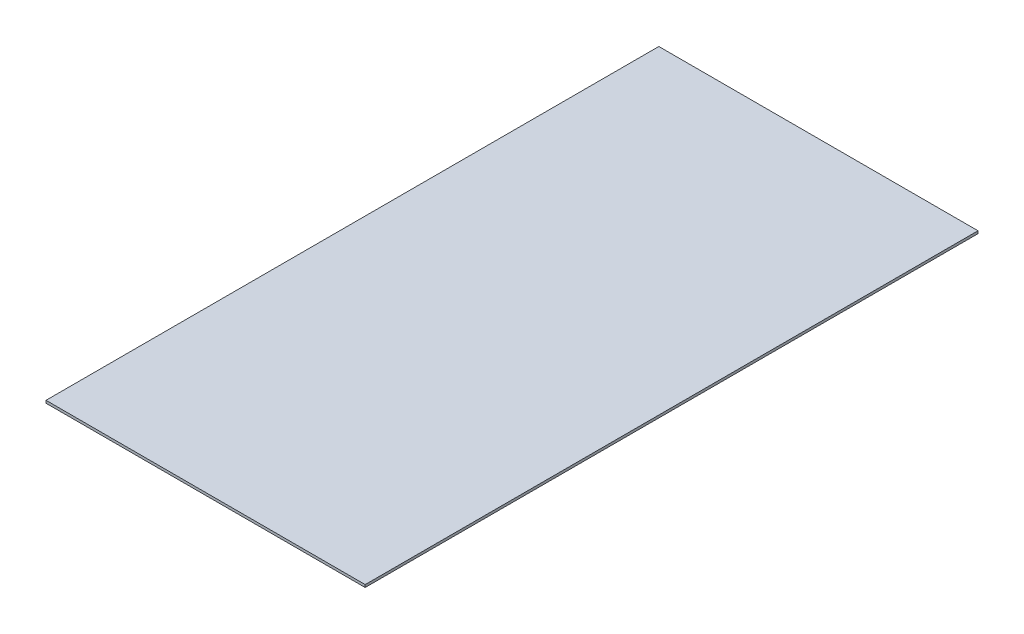
ISO-10303-21;
HEADER;
FILE_DESCRIPTION(('STEP AP214'),'2;1');
FILE_NAME('part.step','',(''),(''),'','','');
FILE_SCHEMA(('AUTOMOTIVE_DESIGN { 1 0 10303 214 1 1 1 1 }'));
ENDSEC;
DATA;
#1=APPLICATION_CONTEXT('core data for automotive mechanical design processes');
#2=APPLICATION_PROTOCOL_DEFINITION('international standard','automotive_design',2000,#1);
#3=PRODUCT_CONTEXT('',#1,'mechanical');
#4=PRODUCT('Part','Part','',(#3));
#5=PRODUCT_RELATED_PRODUCT_CATEGORY('part','',(#4));
#6=PRODUCT_DEFINITION_FORMATION('','',#4);
#7=PRODUCT_DEFINITION_CONTEXT('part definition',#1,'design');
#8=PRODUCT_DEFINITION('design','',#6,#7);
#9=PRODUCT_DEFINITION_SHAPE('','',#8);
#10=(LENGTH_UNIT() NAMED_UNIT(*) SI_UNIT(.MILLI.,.METRE.));
#11=(NAMED_UNIT(*) PLANE_ANGLE_UNIT() SI_UNIT($,.RADIAN.));
#12=(NAMED_UNIT(*) SI_UNIT($,.STERADIAN.) SOLID_ANGLE_UNIT());
#13=UNCERTAINTY_MEASURE_WITH_UNIT(LENGTH_MEASURE(1.E-05),#10,'distance_accuracy_value','');
#14=(GEOMETRIC_REPRESENTATION_CONTEXT(3) GLOBAL_UNCERTAINTY_ASSIGNED_CONTEXT((#13)) GLOBAL_UNIT_ASSIGNED_CONTEXT((#10,
#11,#12)) REPRESENTATION_CONTEXT('',''));
#15=CARTESIAN_POINT('',(0.,0.,0.));
#16=DIRECTION('',(0.,0.,1.));
#17=DIRECTION('',(1.,0.,0.));
#18=AXIS2_PLACEMENT_3D('',#15,#16,#17);
#19=CARTESIAN_POINT('',(0.,2.53999999999999,0.));
#20=DIRECTION('',(0.999999999999999,0.,0.));
#21=DIRECTION('',(0.,0.,-1.));
#22=AXIS2_PLACEMENT_3D('',#19,#20,#21);
#23=PLANE('',#22);
#24=DIRECTION('',(0.,0.,1.));
#25=VECTOR('',#24,1.);
#26=CARTESIAN_POINT('',(0.,0.,0.));
#27=LINE('',#26,#25);
#28=CARTESIAN_POINT('',(-2.22044604925031E-13,0.,-609.6));
#29=VERTEX_POINT('',#28);
#30=CARTESIAN_POINT('',(0.,0.,0.));
#31=VERTEX_POINT('',#30);
#32=EDGE_CURVE('E97',#29,#31,#27,.T.);
#33=ORIENTED_EDGE('',*,*,#32,.T.);
#34=DIRECTION('',(0.,-1.,0.));
#35=VECTOR('',#34,1.);
#36=CARTESIAN_POINT('',(0.,2.53999999999999,0.));
#37=LINE('',#36,#35);
#38=CARTESIAN_POINT('',(0.,2.53999999999999,0.));
#39=VERTEX_POINT('',#38);
#40=EDGE_CURVE('E11',#39,#31,#37,.T.);
#41=ORIENTED_EDGE('',*,*,#40,.F.);
#42=DIRECTION('',(0.,0.,1.));
#43=VECTOR('',#42,1.);
#44=CARTESIAN_POINT('',(0.,2.53999999999999,0.));
#45=LINE('',#44,#43);
#46=CARTESIAN_POINT('',(-2.22044604925031E-13,2.53999999999999,-609.6));
#47=VERTEX_POINT('',#46);
#48=EDGE_CURVE('E85',#47,#39,#45,.T.);
#49=ORIENTED_EDGE('',*,*,#48,.F.);
#50=DIRECTION('',(0.,-1.,0.));
#51=VECTOR('',#50,1.);
#52=CARTESIAN_POINT('',(-2.22044604925031E-13,2.53999999999999,-609.6));
#53=LINE('',#52,#51);
#54=EDGE_CURVE('E93',#47,#29,#53,.T.);
#55=ORIENTED_EDGE('',*,*,#54,.T.);
#56=EDGE_LOOP('',(#33,#41,#49,#55));
#57=FACE_BOUND('',#56,.T.);
#58=ADVANCED_FACE('F34',(#57),#23,.F.);
#59=CARTESIAN_POINT('',(0.,2.53999999999999,0.));
#60=DIRECTION('',(0.,0.,-1.));
#61=DIRECTION('',(-0.999999999999999,0.,0.));
#62=AXIS2_PLACEMENT_3D('',#59,#60,#61);
#63=PLANE('',#62);
#64=DIRECTION('',(0.999999999999999,0.,0.));
#65=VECTOR('',#64,1.);
#66=CARTESIAN_POINT('',(0.,0.,0.));
#67=LINE('',#66,#65);
#68=CARTESIAN_POINT('',(317.5,0.,0.));
#69=VERTEX_POINT('',#68);
#70=EDGE_CURVE('E89',#31,#69,#67,.T.);
#71=ORIENTED_EDGE('',*,*,#70,.T.);
#72=DIRECTION('',(0.,-1.,0.));
#73=VECTOR('',#72,1.);
#74=CARTESIAN_POINT('',(317.5,2.53999999999999,0.));
#75=LINE('',#74,#73);
#76=CARTESIAN_POINT('',(317.5,2.53999999999999,0.));
#77=VERTEX_POINT('',#76);
#78=EDGE_CURVE('E42',#77,#69,#75,.T.);
#79=ORIENTED_EDGE('',*,*,#78,.F.);
#80=DIRECTION('',(0.999999999999999,0.,0.));
#81=VECTOR('',#80,1.);
#82=CARTESIAN_POINT('',(0.,2.53999999999999,0.));
#83=LINE('',#82,#81);
#84=EDGE_CURVE('E80',#39,#77,#83,.T.);
#85=ORIENTED_EDGE('',*,*,#84,.F.);
#86=ORIENTED_EDGE('',*,*,#40,.T.);
#87=EDGE_LOOP('',(#71,#79,#85,#86));
#88=FACE_BOUND('',#87,.T.);
#89=ADVANCED_FACE('F88',(#88),#63,.F.);
#90=CARTESIAN_POINT('',(317.5,2.53999999999999,0.));
#91=DIRECTION('',(-0.999999999999999,0.,0.));
#92=DIRECTION('',(0.,0.,1.));
#93=AXIS2_PLACEMENT_3D('',#90,#91,#92);
#94=PLANE('',#93);
#95=DIRECTION('',(0.,0.,-1.));
#96=VECTOR('',#95,1.);
#97=CARTESIAN_POINT('',(317.5,0.,0.));
#98=LINE('',#97,#96);
#99=CARTESIAN_POINT('',(317.5,0.,-609.6));
#100=VERTEX_POINT('',#99);
#101=EDGE_CURVE('E67',#69,#100,#98,.T.);
#102=ORIENTED_EDGE('',*,*,#101,.T.);
#103=DIRECTION('',(0.,-1.,0.));
#104=VECTOR('',#103,1.);
#105=CARTESIAN_POINT('',(317.5,2.53999999999999,-609.6));
#106=LINE('',#105,#104);
#107=CARTESIAN_POINT('',(317.5,2.53999999999999,-609.6));
#108=VERTEX_POINT('',#107);
#109=EDGE_CURVE('E90',#108,#100,#106,.T.);
#110=ORIENTED_EDGE('',*,*,#109,.F.);
#111=DIRECTION('',(0.,0.,-1.));
#112=VECTOR('',#111,1.);
#113=CARTESIAN_POINT('',(317.5,2.53999999999999,0.));
#114=LINE('',#113,#112);
#115=EDGE_CURVE('E83',#77,#108,#114,.T.);
#116=ORIENTED_EDGE('',*,*,#115,.F.);
#117=ORIENTED_EDGE('',*,*,#78,.T.);
#118=EDGE_LOOP('',(#102,#110,#116,#117));
#119=FACE_BOUND('',#118,.T.);
#120=ADVANCED_FACE('F91',(#119),#94,.F.);
#121=CARTESIAN_POINT('',(-2.22044604925031E-13,2.53999999999999,-609.6));
#122=DIRECTION('',(0.,0.,1.));
#123=DIRECTION('',(0.999999999999999,0.,0.));
#124=AXIS2_PLACEMENT_3D('',#121,#122,#123);
#125=PLANE('',#124);
#126=DIRECTION('',(-0.999999999999999,0.,0.));
#127=VECTOR('',#126,1.);
#128=CARTESIAN_POINT('',(-2.22044604925031E-13,0.,-609.6));
#129=LINE('',#128,#127);
#130=EDGE_CURVE('E73',#100,#29,#129,.T.);
#131=ORIENTED_EDGE('',*,*,#130,.T.);
#132=ORIENTED_EDGE('',*,*,#54,.F.);
#133=DIRECTION('',(-0.999999999999999,0.,0.));
#134=VECTOR('',#133,1.);
#135=CARTESIAN_POINT('',(-2.22044604925031E-13,2.53999999999999,-609.6));
#136=LINE('',#135,#134);
#137=EDGE_CURVE('E50',#108,#47,#136,.T.);
#138=ORIENTED_EDGE('',*,*,#137,.F.);
#139=ORIENTED_EDGE('',*,*,#109,.T.);
#140=EDGE_LOOP('',(#131,#132,#138,#139));
#141=FACE_BOUND('',#140,.T.);
#142=ADVANCED_FACE('F104',(#141),#125,.F.);
#143=CARTESIAN_POINT('',(0.,2.53999999999999,0.));
#144=DIRECTION('',(0.,-1.,0.));
#145=DIRECTION('',(0.,0.,-1.));
#146=AXIS2_PLACEMENT_3D('',#143,#144,#145);
#147=PLANE('',#146);
#148=ORIENTED_EDGE('',*,*,#48,.T.);
#149=ORIENTED_EDGE('',*,*,#84,.T.);
#150=ORIENTED_EDGE('',*,*,#115,.T.);
#151=ORIENTED_EDGE('',*,*,#137,.T.);
#152=EDGE_LOOP('',(#148,#149,#150,#151));
#153=FACE_BOUND('',#152,.T.);
#154=ADVANCED_FACE('F81',(#153),#147,.F.);
#155=CARTESIAN_POINT('',(0.,0.,0.));
#156=DIRECTION('',(0.,-1.,0.));
#157=DIRECTION('',(0.,0.,-1.));
#158=AXIS2_PLACEMENT_3D('',#155,#156,#157);
#159=PLANE('',#158);
#160=ORIENTED_EDGE('',*,*,#32,.F.);
#161=ORIENTED_EDGE('',*,*,#130,.F.);
#162=ORIENTED_EDGE('',*,*,#101,.F.);
#163=ORIENTED_EDGE('',*,*,#70,.F.);
#164=EDGE_LOOP('',(#160,#161,#162,#163));
#165=FACE_BOUND('',#164,.T.);
#166=ADVANCED_FACE('F107',(#165),#159,.T.);
#167=CLOSED_SHELL('',(#58,#89,#120,#142,#154,#166));
#168=MANIFOLD_SOLID_BREP('B2',#167);
#169=ADVANCED_BREP_SHAPE_REPRESENTATION('',(#18,#168),#14);
#170=SHAPE_DEFINITION_REPRESENTATION(#9,#169);
ENDSEC;
END-ISO-10303-21;
